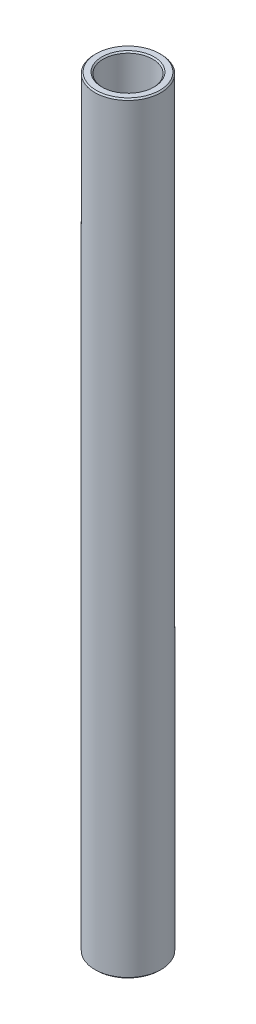
ISO-10303-21;
HEADER;
FILE_DESCRIPTION(('STEP AP214'),'2;1');
FILE_NAME('part.step','',(''),(''),'','','');
FILE_SCHEMA(('AUTOMOTIVE_DESIGN { 1 0 10303 214 1 1 1 1 }'));
ENDSEC;
DATA;
#1=APPLICATION_CONTEXT('core data for automotive mechanical design processes');
#2=APPLICATION_PROTOCOL_DEFINITION('international standard','automotive_design',2000,#1);
#3=PRODUCT_CONTEXT('',#1,'mechanical');
#4=PRODUCT('Part','Part','',(#3));
#5=PRODUCT_RELATED_PRODUCT_CATEGORY('part','',(#4));
#6=PRODUCT_DEFINITION_FORMATION('','',#4);
#7=PRODUCT_DEFINITION_CONTEXT('part definition',#1,'design');
#8=PRODUCT_DEFINITION('design','',#6,#7);
#9=PRODUCT_DEFINITION_SHAPE('','',#8);
#10=(LENGTH_UNIT() NAMED_UNIT(*) SI_UNIT(.MILLI.,.METRE.));
#11=(NAMED_UNIT(*) PLANE_ANGLE_UNIT() SI_UNIT($,.RADIAN.));
#12=(NAMED_UNIT(*) SI_UNIT($,.STERADIAN.) SOLID_ANGLE_UNIT());
#13=UNCERTAINTY_MEASURE_WITH_UNIT(LENGTH_MEASURE(1.E-05),#10,'distance_accuracy_value','');
#14=(GEOMETRIC_REPRESENTATION_CONTEXT(3) GLOBAL_UNCERTAINTY_ASSIGNED_CONTEXT((#13)) GLOBAL_UNIT_ASSIGNED_CONTEXT((#10,
#11,#12)) REPRESENTATION_CONTEXT('',''));
#15=CARTESIAN_POINT('',(0.,0.,0.));
#16=DIRECTION('',(0.,0.,1.));
#17=DIRECTION('',(1.,0.,0.));
#18=AXIS2_PLACEMENT_3D('',#15,#16,#17);
#19=CARTESIAN_POINT('',(0.,11.60859375,0.));
#20=DIRECTION('',(0.,1.,0.));
#21=DIRECTION('',(-1.,0.,0.));
#22=AXIS2_PLACEMENT_3D('',#19,#20,#21);
#23=CYLINDRICAL_SURFACE('',#22,4.7625);
#24=CARTESIAN_POINT('',(0.,-72.8630877,0.));
#25=DIRECTION('',(0.,1.,0.));
#26=DIRECTION('',(-1.,0.,0.));
#27=AXIS2_PLACEMENT_3D('',#24,#25,#26);
#28=CIRCLE('',#27,4.7625);
#29=CARTESIAN_POINT('',(-4.76250000000001,-72.8630877,0.));
#30=VERTEX_POINT('',#29);
#31=EDGE_CURVE('E50',#30,#30,#28,.F.);
#32=ORIENTED_EDGE('',*,*,#31,.T.);
#33=EDGE_LOOP('',(#32));
#34=FACE_BOUND('',#33,.T.);
#35=CARTESIAN_POINT('',(0.,72.8630877,0.));
#36=DIRECTION('',(0.,-1.,0.));
#37=DIRECTION('',(1.,0.,0.));
#38=AXIS2_PLACEMENT_3D('',#35,#36,#37);
#39=CIRCLE('',#38,4.7625);
#40=CARTESIAN_POINT('',(4.76250000000001,72.8630877,0.));
#41=VERTEX_POINT('',#40);
#42=EDGE_CURVE('E53',#41,#41,#39,.F.);
#43=ORIENTED_EDGE('',*,*,#42,.T.);
#44=EDGE_LOOP('',(#43));
#45=FACE_BOUND('',#44,.T.);
#46=ADVANCED_FACE('F30',(#34,#45),#23,.F.);
#47=CARTESIAN_POINT('',(4.76249999999999,73.1170877,0.));
#48=DIRECTION('',(0.,-1.,0.));
#49=DIRECTION('',(1.,0.,0.));
#50=AXIS2_PLACEMENT_3D('',#47,#48,#49);
#51=PLANE('',#50);
#52=CARTESIAN_POINT('',(0.,73.1170877,0.));
#53=DIRECTION('',(0.,-1.,0.));
#54=DIRECTION('',(1.,0.,0.));
#55=AXIS2_PLACEMENT_3D('',#52,#53,#54);
#56=CIRCLE('',#55,6.096);
#57=CARTESIAN_POINT('',(6.09600000000001,73.1170877,0.));
#58=VERTEX_POINT('',#57);
#59=EDGE_CURVE('E10',#58,#58,#56,.F.);
#60=ORIENTED_EDGE('',*,*,#59,.T.);
#61=EDGE_LOOP('',(#60));
#62=FACE_BOUND('',#61,.T.);
#63=CARTESIAN_POINT('',(0.,73.1170877,0.));
#64=DIRECTION('',(0.,-1.,0.));
#65=DIRECTION('',(1.,0.,0.));
#66=AXIS2_PLACEMENT_3D('',#63,#64,#65);
#67=CIRCLE('',#66,5.01650000000002);
#68=CARTESIAN_POINT('',(5.01650000000003,73.1170877,0.));
#69=VERTEX_POINT('',#68);
#70=EDGE_CURVE('E37',#69,#69,#67,.T.);
#71=ORIENTED_EDGE('',*,*,#70,.T.);
#72=EDGE_LOOP('',(#71));
#73=FACE_BOUND('',#72,.T.);
#74=ADVANCED_FACE('F76',(#62,#73),#51,.F.);
#75=CARTESIAN_POINT('',(0.,11.60859375,0.));
#76=DIRECTION('',(0.,1.,0.));
#77=DIRECTION('',(-1.,0.,0.));
#78=AXIS2_PLACEMENT_3D('',#75,#76,#77);
#79=CYLINDRICAL_SURFACE('',#78,6.35);
#80=CARTESIAN_POINT('',(0.,-72.8630877,0.));
#81=DIRECTION('',(0.,1.,0.));
#82=DIRECTION('',(-1.,0.,0.));
#83=AXIS2_PLACEMENT_3D('',#80,#81,#82);
#84=CIRCLE('',#83,6.35);
#85=CARTESIAN_POINT('',(-6.35000000000001,-72.8630877,0.));
#86=VERTEX_POINT('',#85);
#87=EDGE_CURVE('E41',#86,#86,#84,.T.);
#88=ORIENTED_EDGE('',*,*,#87,.T.);
#89=EDGE_LOOP('',(#88));
#90=FACE_BOUND('',#89,.T.);
#91=CARTESIAN_POINT('',(0.,72.8630877,0.));
#92=DIRECTION('',(0.,-1.,0.));
#93=DIRECTION('',(1.,0.,0.));
#94=AXIS2_PLACEMENT_3D('',#91,#92,#93);
#95=CIRCLE('',#94,6.35);
#96=CARTESIAN_POINT('',(6.35000000000001,72.8630877,0.));
#97=VERTEX_POINT('',#96);
#98=EDGE_CURVE('E45',#97,#97,#95,.T.);
#99=ORIENTED_EDGE('',*,*,#98,.T.);
#100=EDGE_LOOP('',(#99));
#101=FACE_BOUND('',#100,.T.);
#102=ADVANCED_FACE('F73',(#90,#101),#79,.T.);
#103=CARTESIAN_POINT('',(6.35000000000001,-73.1170877,0.));
#104=DIRECTION('',(0.,1.,0.));
#105=DIRECTION('',(-1.,0.,0.));
#106=AXIS2_PLACEMENT_3D('',#103,#104,#105);
#107=PLANE('',#106);
#108=CARTESIAN_POINT('',(0.,-73.1170877,0.));
#109=DIRECTION('',(0.,1.,0.));
#110=DIRECTION('',(-1.,0.,0.));
#111=AXIS2_PLACEMENT_3D('',#108,#109,#110);
#112=CIRCLE('',#111,5.01650000000002);
#113=CARTESIAN_POINT('',(-5.01650000000003,-73.1170877,0.));
#114=VERTEX_POINT('',#113);
#115=EDGE_CURVE('E56',#114,#114,#112,.T.);
#116=ORIENTED_EDGE('',*,*,#115,.T.);
#117=EDGE_LOOP('',(#116));
#118=FACE_BOUND('',#117,.T.);
#119=CARTESIAN_POINT('',(0.,-73.1170877,0.));
#120=DIRECTION('',(0.,1.,0.));
#121=DIRECTION('',(-1.,0.,0.));
#122=AXIS2_PLACEMENT_3D('',#119,#120,#121);
#123=CIRCLE('',#122,6.09599999999995);
#124=CARTESIAN_POINT('',(-6.09599999999996,-73.1170877,0.));
#125=VERTEX_POINT('',#124);
#126=EDGE_CURVE('E59',#125,#125,#123,.F.);
#127=ORIENTED_EDGE('',*,*,#126,.T.);
#128=EDGE_LOOP('',(#127));
#129=FACE_BOUND('',#128,.T.);
#130=ADVANCED_FACE('F63',(#118,#129),#107,.F.);
#131=CARTESIAN_POINT('',(0.,-73.1170877,0.));
#132=DIRECTION('',(0.,-1.,0.));
#133=DIRECTION('',(1.,0.,0.));
#134=AXIS2_PLACEMENT_3D('',#131,#132,#133);
#135=CONICAL_SURFACE('',#134,5.01650000000002,0.78539816339743);
#136=ORIENTED_EDGE('',*,*,#31,.F.);
#137=EDGE_LOOP('',(#136));
#138=FACE_BOUND('',#137,.T.);
#139=ORIENTED_EDGE('',*,*,#115,.F.);
#140=EDGE_LOOP('',(#139));
#141=FACE_BOUND('',#140,.T.);
#142=ADVANCED_FACE('F69',(#138,#141),#135,.F.);
#143=CARTESIAN_POINT('',(0.,-72.8630877,0.));
#144=DIRECTION('',(0.,1.,0.));
#145=DIRECTION('',(-1.,0.,0.));
#146=AXIS2_PLACEMENT_3D('',#143,#144,#145);
#147=CONICAL_SURFACE('',#146,6.35,0.78539816339746);
#148=ORIENTED_EDGE('',*,*,#126,.F.);
#149=EDGE_LOOP('',(#148));
#150=FACE_BOUND('',#149,.T.);
#151=ORIENTED_EDGE('',*,*,#87,.F.);
#152=EDGE_LOOP('',(#151));
#153=FACE_BOUND('',#152,.T.);
#154=ADVANCED_FACE('F65',(#150,#153),#147,.T.);
#155=CARTESIAN_POINT('',(0.,73.1170877,0.));
#156=DIRECTION('',(0.,-1.,0.));
#157=DIRECTION('',(1.,0.,0.));
#158=AXIS2_PLACEMENT_3D('',#155,#156,#157);
#159=CONICAL_SURFACE('',#158,6.096,0.785398163397433);
#160=ORIENTED_EDGE('',*,*,#98,.F.);
#161=EDGE_LOOP('',(#160));
#162=FACE_BOUND('',#161,.T.);
#163=ORIENTED_EDGE('',*,*,#59,.F.);
#164=EDGE_LOOP('',(#163));
#165=FACE_BOUND('',#164,.T.);
#166=ADVANCED_FACE('F68',(#162,#165),#159,.T.);
#167=CARTESIAN_POINT('',(0.,72.8630877,0.));
#168=DIRECTION('',(0.,1.,0.));
#169=DIRECTION('',(-1.,0.,0.));
#170=AXIS2_PLACEMENT_3D('',#167,#168,#169);
#171=CONICAL_SURFACE('',#170,4.7625,0.785398163397457);
#172=ORIENTED_EDGE('',*,*,#70,.F.);
#173=EDGE_LOOP('',(#172));
#174=FACE_BOUND('',#173,.T.);
#175=ORIENTED_EDGE('',*,*,#42,.F.);
#176=EDGE_LOOP('',(#175));
#177=FACE_BOUND('',#176,.T.);
#178=ADVANCED_FACE('F32',(#174,#177),#171,.F.);
#179=CLOSED_SHELL('',(#46,#74,#102,#130,#142,#154,#166,#178));
#180=MANIFOLD_SOLID_BREP('B2',#179);
#181=ADVANCED_BREP_SHAPE_REPRESENTATION('',(#18,#180),#14);
#182=SHAPE_DEFINITION_REPRESENTATION(#9,#181);
ENDSEC;
END-ISO-10303-21;
